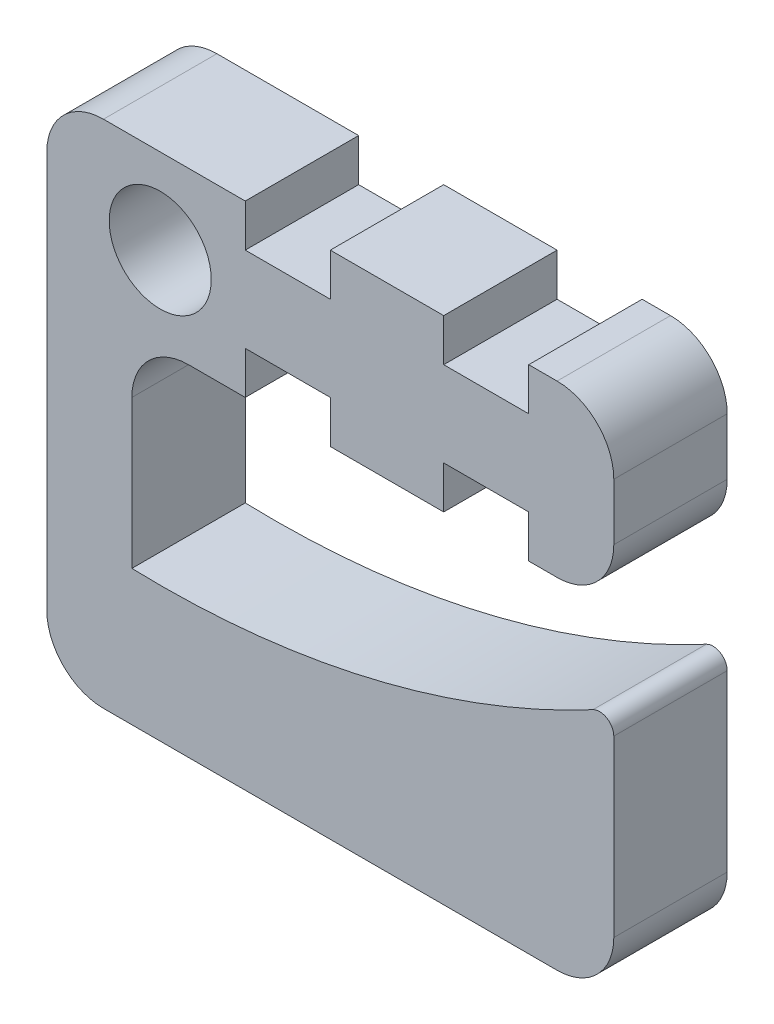
ISO-10303-21;
HEADER;
FILE_DESCRIPTION(('STEP AP214'),'2;1');
FILE_NAME('part.step','',(''),(''),'','','');
FILE_SCHEMA(('AUTOMOTIVE_DESIGN { 1 0 10303 214 1 1 1 1 }'));
ENDSEC;
DATA;
#1=APPLICATION_CONTEXT('core data for automotive mechanical design processes');
#2=APPLICATION_PROTOCOL_DEFINITION('international standard','automotive_design',2000,#1);
#3=PRODUCT_CONTEXT('',#1,'mechanical');
#4=PRODUCT('Part','Part','',(#3));
#5=PRODUCT_RELATED_PRODUCT_CATEGORY('part','',(#4));
#6=PRODUCT_DEFINITION_FORMATION('','',#4);
#7=PRODUCT_DEFINITION_CONTEXT('part definition',#1,'design');
#8=PRODUCT_DEFINITION('design','',#6,#7);
#9=PRODUCT_DEFINITION_SHAPE('','',#8);
#10=(LENGTH_UNIT() NAMED_UNIT(*) SI_UNIT(.MILLI.,.METRE.));
#11=(NAMED_UNIT(*) PLANE_ANGLE_UNIT() SI_UNIT($,.RADIAN.));
#12=(NAMED_UNIT(*) SI_UNIT($,.STERADIAN.) SOLID_ANGLE_UNIT());
#13=UNCERTAINTY_MEASURE_WITH_UNIT(LENGTH_MEASURE(1.E-05),#10,'distance_accuracy_value','');
#14=(GEOMETRIC_REPRESENTATION_CONTEXT(3) GLOBAL_UNCERTAINTY_ASSIGNED_CONTEXT((#13)) GLOBAL_UNIT_ASSIGNED_CONTEXT((#10,
#11,#12)) REPRESENTATION_CONTEXT('',''));
#15=CARTESIAN_POINT('',(0.,0.,0.));
#16=DIRECTION('',(0.,0.,1.));
#17=DIRECTION('',(1.,0.,0.));
#18=AXIS2_PLACEMENT_3D('',#15,#16,#17);
#19=CARTESIAN_POINT('',(0.,-3.81,5.08));
#20=DIRECTION('',(0.,-1.,0.));
#21=DIRECTION('',(1.,0.,0.));
#22=AXIS2_PLACEMENT_3D('',#19,#20,#21);
#23=PLANE('',#22);
#24=DIRECTION('',(-1.,0.,0.));
#25=VECTOR('',#24,1.);
#26=CARTESIAN_POINT('',(0.,-3.81,0.));
#27=LINE('',#26,#25);
#28=CARTESIAN_POINT('',(3.81,-3.81,0.));
#29=VERTEX_POINT('',#28);
#30=CARTESIAN_POINT('',(1.27,-3.81,0.));
#31=VERTEX_POINT('',#30);
#32=EDGE_CURVE('E466',#29,#31,#27,.T.);
#33=ORIENTED_EDGE('',*,*,#32,.F.);
#34=DIRECTION('',(0.,0.,1.));
#35=VECTOR('',#34,1.);
#36=CARTESIAN_POINT('',(3.81,-3.81,0.));
#37=LINE('',#36,#35);
#38=CARTESIAN_POINT('',(3.81,-3.81,5.08));
#39=VERTEX_POINT('',#38);
#40=EDGE_CURVE('E310',#29,#39,#37,.T.);
#41=ORIENTED_EDGE('',*,*,#40,.T.);
#42=DIRECTION('',(-1.,0.,0.));
#43=VECTOR('',#42,1.);
#44=CARTESIAN_POINT('',(0.,-3.81,5.08));
#45=LINE('',#44,#43);
#46=CARTESIAN_POINT('',(1.27,-3.81,5.08));
#47=VERTEX_POINT('',#46);
#48=EDGE_CURVE('E427',#39,#47,#45,.T.);
#49=ORIENTED_EDGE('',*,*,#48,.T.);
#50=DIRECTION('',(0.,0.,-1.));
#51=VECTOR('',#50,1.);
#52=CARTESIAN_POINT('',(1.27,-3.81,0.));
#53=LINE('',#52,#51);
#54=EDGE_CURVE('E485',#47,#31,#53,.T.);
#55=ORIENTED_EDGE('',*,*,#54,.T.);
#56=EDGE_LOOP('',(#33,#41,#49,#55));
#57=FACE_BOUND('',#56,.T.);
#58=ADVANCED_FACE('F45',(#57),#23,.T.);
#59=DIRECTION('',(0.,0.,1.));
#60=VECTOR('',#59,1.);
#61=CARTESIAN_POINT('',(7.62,-3.81,0.));
#62=LINE('',#61,#60);
#63=CARTESIAN_POINT('',(7.62,-3.81,0.));
#64=VERTEX_POINT('',#63);
#65=CARTESIAN_POINT('',(7.62,-3.81,5.08));
#66=VERTEX_POINT('',#65);
#67=EDGE_CURVE('E329',#64,#66,#62,.T.);
#68=ORIENTED_EDGE('',*,*,#67,.F.);
#69=CARTESIAN_POINT('',(12.7,-3.81,0.));
#70=VERTEX_POINT('',#69);
#71=EDGE_CURVE('E470',#70,#64,#27,.T.);
#72=ORIENTED_EDGE('',*,*,#71,.F.);
#73=DIRECTION('',(0.,0.,1.));
#74=VECTOR('',#73,1.);
#75=CARTESIAN_POINT('',(12.7,-3.81,0.));
#76=LINE('',#75,#74);
#77=CARTESIAN_POINT('',(12.7,-3.81,5.08));
#78=VERTEX_POINT('',#77);
#79=EDGE_CURVE('E293',#70,#78,#76,.T.);
#80=ORIENTED_EDGE('',*,*,#79,.T.);
#81=EDGE_CURVE('E433',#78,#66,#45,.T.);
#82=ORIENTED_EDGE('',*,*,#81,.T.);
#83=EDGE_LOOP('',(#68,#72,#80,#82));
#84=FACE_BOUND('',#83,.T.);
#85=ADVANCED_FACE('F606',(#84),#23,.T.);
#86=CARTESIAN_POINT('',(0.,3.81,5.08));
#87=DIRECTION('',(0.,-1.,0.));
#88=DIRECTION('',(1.,0.,0.));
#89=AXIS2_PLACEMENT_3D('',#86,#87,#88);
#90=PLANE('',#89);
#91=DIRECTION('',(0.,0.,1.));
#92=VECTOR('',#91,1.);
#93=CARTESIAN_POINT('',(16.51,3.81,0.));
#94=LINE('',#93,#92);
#95=CARTESIAN_POINT('',(16.51,3.81,0.));
#96=VERTEX_POINT('',#95);
#97=CARTESIAN_POINT('',(16.51,3.81,5.08));
#98=VERTEX_POINT('',#97);
#99=EDGE_CURVE('E346',#96,#98,#94,.T.);
#100=ORIENTED_EDGE('',*,*,#99,.T.);
#101=DIRECTION('',(-1.,0.,0.));
#102=VECTOR('',#101,1.);
#103=CARTESIAN_POINT('',(0.,3.81,5.08));
#104=LINE('',#103,#102);
#105=CARTESIAN_POINT('',(17.78,3.81,5.08));
#106=VERTEX_POINT('',#105);
#107=EDGE_CURVE('E438',#106,#98,#104,.T.);
#108=ORIENTED_EDGE('',*,*,#107,.F.);
#109=DIRECTION('',(0.,0.,-1.));
#110=VECTOR('',#109,1.);
#111=CARTESIAN_POINT('',(17.78,3.81,5.08));
#112=LINE('',#111,#110);
#113=CARTESIAN_POINT('',(17.78,3.81,0.));
#114=VERTEX_POINT('',#113);
#115=EDGE_CURVE('E541',#106,#114,#112,.T.);
#116=ORIENTED_EDGE('',*,*,#115,.T.);
#117=DIRECTION('',(-1.,0.,0.));
#118=VECTOR('',#117,1.);
#119=CARTESIAN_POINT('',(0.,3.81,0.));
#120=LINE('',#119,#118);
#121=EDGE_CURVE('E408',#114,#96,#120,.T.);
#122=ORIENTED_EDGE('',*,*,#121,.T.);
#123=EDGE_LOOP('',(#100,#108,#116,#122));
#124=FACE_BOUND('',#123,.T.);
#125=ADVANCED_FACE('F635',(#124),#90,.F.);
#126=CARTESIAN_POINT('',(12.7,3.81,5.08));
#127=VERTEX_POINT('',#126);
#128=CARTESIAN_POINT('',(7.62,3.81,5.08));
#129=VERTEX_POINT('',#128);
#130=EDGE_CURVE('E443',#127,#129,#104,.T.);
#131=ORIENTED_EDGE('',*,*,#130,.F.);
#132=DIRECTION('',(0.,0.,1.));
#133=VECTOR('',#132,1.);
#134=CARTESIAN_POINT('',(12.7,3.81,0.));
#135=LINE('',#134,#133);
#136=CARTESIAN_POINT('',(12.7,3.81,0.));
#137=VERTEX_POINT('',#136);
#138=EDGE_CURVE('E361',#137,#127,#135,.T.);
#139=ORIENTED_EDGE('',*,*,#138,.F.);
#140=CARTESIAN_POINT('',(7.62,3.81,0.));
#141=VERTEX_POINT('',#140);
#142=EDGE_CURVE('E478',#137,#141,#120,.T.);
#143=ORIENTED_EDGE('',*,*,#142,.T.);
#144=DIRECTION('',(0.,0.,1.));
#145=VECTOR('',#144,1.);
#146=CARTESIAN_POINT('',(7.62,3.81,0.));
#147=LINE('',#146,#145);
#148=EDGE_CURVE('E379',#141,#129,#147,.T.);
#149=ORIENTED_EDGE('',*,*,#148,.T.);
#150=EDGE_LOOP('',(#131,#139,#143,#149));
#151=FACE_BOUND('',#150,.T.);
#152=ADVANCED_FACE('F677',(#151),#90,.F.);
#153=CARTESIAN_POINT('',(0.,0.,5.08));
#154=DIRECTION('',(0.,0.,1.));
#155=DIRECTION('',(1.,0.,0.));
#156=AXIS2_PLACEMENT_3D('',#153,#154,#155);
#157=PLANE('',#156);
#158=CARTESIAN_POINT('',(0.,0.,5.08));
#159=DIRECTION('',(0.,0.,1.));
#160=DIRECTION('',(1.,0.,0.));
#161=AXIS2_PLACEMENT_3D('',#158,#159,#160);
#162=CIRCLE('',#161,2.286);
#163=CARTESIAN_POINT('',(2.286,0.,5.08));
#164=VERTEX_POINT('',#163);
#165=EDGE_CURVE('E403',#164,#164,#162,.T.);
#166=ORIENTED_EDGE('',*,*,#165,.F.);
#167=EDGE_LOOP('',(#166));
#168=FACE_BOUND('',#167,.T.);
#169=ORIENTED_EDGE('',*,*,#48,.F.);
#170=DIRECTION('',(0.,1.,0.));
#171=VECTOR('',#170,1.);
#172=CARTESIAN_POINT('',(3.81,0.,5.08));
#173=LINE('',#172,#171);
#174=CARTESIAN_POINT('',(3.81,-1.905,5.08));
#175=VERTEX_POINT('',#174);
#176=EDGE_CURVE('E311',#39,#175,#173,.T.);
#177=ORIENTED_EDGE('',*,*,#176,.T.);
#178=DIRECTION('',(1.,0.,0.));
#179=VECTOR('',#178,1.);
#180=CARTESIAN_POINT('',(0.,-1.905,5.08));
#181=LINE('',#180,#179);
#182=CARTESIAN_POINT('',(7.62,-1.905,5.08));
#183=VERTEX_POINT('',#182);
#184=EDGE_CURVE('E303',#175,#183,#181,.T.);
#185=ORIENTED_EDGE('',*,*,#184,.T.);
#186=DIRECTION('',(0.,1.,0.));
#187=VECTOR('',#186,1.);
#188=CARTESIAN_POINT('',(7.62,0.,5.08));
#189=LINE('',#188,#187);
#190=EDGE_CURVE('E315',#66,#183,#189,.T.);
#191=ORIENTED_EDGE('',*,*,#190,.F.);
#192=ORIENTED_EDGE('',*,*,#81,.F.);
#193=DIRECTION('',(0.,1.,0.));
#194=VECTOR('',#193,1.);
#195=CARTESIAN_POINT('',(12.7,0.,5.08));
#196=LINE('',#195,#194);
#197=CARTESIAN_POINT('',(12.7,-1.905,5.08));
#198=VERTEX_POINT('',#197);
#199=EDGE_CURVE('E276',#78,#198,#196,.T.);
#200=ORIENTED_EDGE('',*,*,#199,.T.);
#201=DIRECTION('',(-1.,0.,0.));
#202=VECTOR('',#201,1.);
#203=CARTESIAN_POINT('',(0.,-1.905,5.08));
#204=LINE('',#203,#202);
#205=CARTESIAN_POINT('',(16.51,-1.905,5.08));
#206=VERTEX_POINT('',#205);
#207=EDGE_CURVE('E280',#206,#198,#204,.T.);
#208=ORIENTED_EDGE('',*,*,#207,.F.);
#209=DIRECTION('',(0.,1.,0.));
#210=VECTOR('',#209,1.);
#211=CARTESIAN_POINT('',(16.51,0.,5.08));
#212=LINE('',#211,#210);
#213=CARTESIAN_POINT('',(16.51,-3.81,5.08));
#214=VERTEX_POINT('',#213);
#215=EDGE_CURVE('E254',#214,#206,#212,.T.);
#216=ORIENTED_EDGE('',*,*,#215,.F.);
#217=CARTESIAN_POINT('',(17.78,-3.81,5.08));
#218=VERTEX_POINT('',#217);
#219=EDGE_CURVE('E428',#218,#214,#45,.T.);
#220=ORIENTED_EDGE('',*,*,#219,.F.);
#221=CARTESIAN_POINT('',(17.78,-1.27,5.08));
#222=DIRECTION('',(0.,0.,1.));
#223=DIRECTION('',(1.,0.,0.));
#224=AXIS2_PLACEMENT_3D('',#221,#222,#223);
#225=CIRCLE('',#224,2.54);
#226=CARTESIAN_POINT('',(20.32,-1.27,5.08));
#227=VERTEX_POINT('',#226);
#228=EDGE_CURVE('E519',#218,#227,#225,.T.);
#229=ORIENTED_EDGE('',*,*,#228,.T.);
#230=DIRECTION('',(0.,1.,0.));
#231=VECTOR('',#230,1.);
#232=CARTESIAN_POINT('',(20.32,0.,5.08));
#233=LINE('',#232,#231);
#234=CARTESIAN_POINT('',(20.32,1.27,5.08));
#235=VERTEX_POINT('',#234);
#236=EDGE_CURVE('E432',#227,#235,#233,.T.);
#237=ORIENTED_EDGE('',*,*,#236,.T.);
#238=CARTESIAN_POINT('',(17.78,1.27,5.08));
#239=DIRECTION('',(0.,0.,1.));
#240=DIRECTION('',(1.,0.,0.));
#241=AXIS2_PLACEMENT_3D('',#238,#239,#240);
#242=CIRCLE('',#241,2.54);
#243=EDGE_CURVE('E522',#235,#106,#242,.T.);
#244=ORIENTED_EDGE('',*,*,#243,.T.);
#245=ORIENTED_EDGE('',*,*,#107,.T.);
#246=DIRECTION('',(0.,-1.,0.));
#247=VECTOR('',#246,1.);
#248=CARTESIAN_POINT('',(16.51,0.,5.08));
#249=LINE('',#248,#247);
#250=CARTESIAN_POINT('',(16.51,1.905,5.08));
#251=VERTEX_POINT('',#250);
#252=EDGE_CURVE('E292',#98,#251,#249,.T.);
#253=ORIENTED_EDGE('',*,*,#252,.T.);
#254=DIRECTION('',(-1.,0.,0.));
#255=VECTOR('',#254,1.);
#256=CARTESIAN_POINT('',(0.,1.90499999999999,5.08));
#257=LINE('',#256,#255);
#258=CARTESIAN_POINT('',(12.7,1.905,5.08));
#259=VERTEX_POINT('',#258);
#260=EDGE_CURVE('E339',#251,#259,#257,.T.);
#261=ORIENTED_EDGE('',*,*,#260,.T.);
#262=DIRECTION('',(0.,-1.,0.));
#263=VECTOR('',#262,1.);
#264=CARTESIAN_POINT('',(12.7,0.,5.08));
#265=LINE('',#264,#263);
#266=EDGE_CURVE('E350',#127,#259,#265,.T.);
#267=ORIENTED_EDGE('',*,*,#266,.F.);
#268=ORIENTED_EDGE('',*,*,#130,.T.);
#269=DIRECTION('',(0.,-1.,0.));
#270=VECTOR('',#269,1.);
#271=CARTESIAN_POINT('',(7.62,0.,5.08));
#272=LINE('',#271,#270);
#273=CARTESIAN_POINT('',(7.62,1.905,5.08));
#274=VERTEX_POINT('',#273);
#275=EDGE_CURVE('E326',#129,#274,#272,.T.);
#276=ORIENTED_EDGE('',*,*,#275,.T.);
#277=DIRECTION('',(1.,0.,0.));
#278=VECTOR('',#277,1.);
#279=CARTESIAN_POINT('',(0.,1.905,5.08));
#280=LINE('',#279,#278);
#281=CARTESIAN_POINT('',(3.81,1.905,5.08));
#282=VERTEX_POINT('',#281);
#283=EDGE_CURVE('E371',#282,#274,#280,.T.);
#284=ORIENTED_EDGE('',*,*,#283,.F.);
#285=DIRECTION('',(0.,-1.,0.));
#286=VECTOR('',#285,1.);
#287=CARTESIAN_POINT('',(3.81,0.,5.08));
#288=LINE('',#287,#286);
#289=CARTESIAN_POINT('',(3.81,3.81,5.08));
#290=VERTEX_POINT('',#289);
#291=EDGE_CURVE('E383',#290,#282,#288,.T.);
#292=ORIENTED_EDGE('',*,*,#291,.F.);
#293=CARTESIAN_POINT('',(-2.54,3.81,5.08));
#294=VERTEX_POINT('',#293);
#295=EDGE_CURVE('E437',#290,#294,#104,.T.);
#296=ORIENTED_EDGE('',*,*,#295,.T.);
#297=CARTESIAN_POINT('',(-2.54,1.27,5.08));
#298=DIRECTION('',(0.,0.,1.));
#299=DIRECTION('',(1.,0.,0.));
#300=AXIS2_PLACEMENT_3D('',#297,#298,#299);
#301=CIRCLE('',#300,2.54);
#302=CARTESIAN_POINT('',(-5.08,1.27,5.08));
#303=VERTEX_POINT('',#302);
#304=EDGE_CURVE('E525',#294,#303,#301,.T.);
#305=ORIENTED_EDGE('',*,*,#304,.T.);
#306=DIRECTION('',(0.,1.,0.));
#307=VECTOR('',#306,1.);
#308=CARTESIAN_POINT('',(-5.08,0.,5.08));
#309=LINE('',#308,#307);
#310=CARTESIAN_POINT('',(-5.08,-16.51,5.08));
#311=VERTEX_POINT('',#310);
#312=EDGE_CURVE('E407',#311,#303,#309,.T.);
#313=ORIENTED_EDGE('',*,*,#312,.F.);
#314=CARTESIAN_POINT('',(-2.54,-16.51,5.08));
#315=DIRECTION('',(0.,0.,1.));
#316=DIRECTION('',(1.,0.,0.));
#317=AXIS2_PLACEMENT_3D('',#314,#315,#316);
#318=CIRCLE('',#317,2.54);
#319=CARTESIAN_POINT('',(-2.54,-19.05,5.08));
#320=VERTEX_POINT('',#319);
#321=EDGE_CURVE('E528',#311,#320,#318,.T.);
#322=ORIENTED_EDGE('',*,*,#321,.T.);
#323=DIRECTION('',(1.,0.,0.));
#324=VECTOR('',#323,1.);
#325=CARTESIAN_POINT('',(0.,-19.05,5.08));
#326=LINE('',#325,#324);
#327=CARTESIAN_POINT('',(17.78,-19.05,5.08));
#328=VERTEX_POINT('',#327);
#329=EDGE_CURVE('E412',#320,#328,#326,.T.);
#330=ORIENTED_EDGE('',*,*,#329,.T.);
#331=CARTESIAN_POINT('',(17.78,-16.51,5.08));
#332=DIRECTION('',(0.,0.,1.));
#333=DIRECTION('',(1.,0.,0.));
#334=AXIS2_PLACEMENT_3D('',#331,#332,#333);
#335=CIRCLE('',#334,2.54);
#336=CARTESIAN_POINT('',(20.32,-16.51,5.08));
#337=VERTEX_POINT('',#336);
#338=EDGE_CURVE('E531',#328,#337,#335,.T.);
#339=ORIENTED_EDGE('',*,*,#338,.T.);
#340=DIRECTION('',(0.,1.,0.));
#341=VECTOR('',#340,1.);
#342=CARTESIAN_POINT('',(20.32,0.,5.08));
#343=LINE('',#342,#341);
#344=CARTESIAN_POINT('',(20.32,-8.69641263375921,5.08));
#345=VERTEX_POINT('',#344);
#346=EDGE_CURVE('E416',#337,#345,#343,.T.);
#347=ORIENTED_EDGE('',*,*,#346,.T.);
#348=CARTESIAN_POINT('',(19.685,-8.69641263375921,5.08));
#349=DIRECTION('',(0.,0.,1.));
#350=DIRECTION('',(1.,0.,0.));
#351=AXIS2_PLACEMENT_3D('',#348,#349,#350);
#352=CIRCLE('',#351,0.635);
#353=CARTESIAN_POINT('',(19.385099474173,-8.13669424509515,5.08));
#354=VERTEX_POINT('',#353);
#355=EDGE_CURVE('E11',#345,#354,#352,.T.);
#356=ORIENTED_EDGE('',*,*,#355,.T.);
#357=CARTESIAN_POINT('',(0.,28.042624253455,5.08));
#358=DIRECTION('',(0.,0.,1.));
#359=DIRECTION('',(1.,0.,0.));
#360=AXIS2_PLACEMENT_3D('',#357,#358,#359);
#361=CIRCLE('',#360,41.0454037456463);
#362=CARTESIAN_POINT('',(-1.27,-12.9831270333053,5.08));
#363=VERTEX_POINT('',#362);
#364=EDGE_CURVE('E420',#354,#363,#361,.F.);
#365=ORIENTED_EDGE('',*,*,#364,.T.);
#366=DIRECTION('',(0.,-1.,0.));
#367=VECTOR('',#366,1.);
#368=CARTESIAN_POINT('',(-1.27,0.,5.08));
#369=LINE('',#368,#367);
#370=CARTESIAN_POINT('',(-1.27,-6.35,5.08));
#371=VERTEX_POINT('',#370);
#372=EDGE_CURVE('E423',#371,#363,#369,.T.);
#373=ORIENTED_EDGE('',*,*,#372,.F.);
#374=CARTESIAN_POINT('',(1.27,-6.35,5.08));
#375=DIRECTION('',(0.,0.,1.));
#376=DIRECTION('',(1.,0.,0.));
#377=AXIS2_PLACEMENT_3D('',#374,#375,#376);
#378=CIRCLE('',#377,2.54);
#379=EDGE_CURVE('E559',#371,#47,#378,.F.);
#380=ORIENTED_EDGE('',*,*,#379,.T.);
#381=EDGE_LOOP('',(#169,#177,#185,#191,#192,#200,#208,#216,#220,#229,#237,#244,#245,#253,#261,
#267,#268,#276,#284,#292,#296,#305,#313,#322,#330,#339,#347,#356,#365,#373,#380));
#382=FACE_BOUND('',#381,.T.);
#383=ADVANCED_FACE('F580',(#168,#382),#157,.T.);
#384=CARTESIAN_POINT('',(0.,0.,0.));
#385=DIRECTION('',(0.,0.,1.));
#386=DIRECTION('',(1.,0.,0.));
#387=AXIS2_PLACEMENT_3D('',#384,#385,#386);
#388=PLANE('',#387);
#389=CARTESIAN_POINT('',(0.,0.,0.));
#390=DIRECTION('',(0.,0.,1.));
#391=DIRECTION('',(1.,0.,0.));
#392=AXIS2_PLACEMENT_3D('',#389,#390,#391);
#393=CIRCLE('',#392,2.286);
#394=CARTESIAN_POINT('',(2.286,0.,0.));
#395=VERTEX_POINT('',#394);
#396=EDGE_CURVE('E393',#395,#395,#393,.T.);
#397=ORIENTED_EDGE('',*,*,#396,.T.);
#398=EDGE_LOOP('',(#397));
#399=FACE_BOUND('',#398,.T.);
#400=DIRECTION('',(0.,1.,0.));
#401=VECTOR('',#400,1.);
#402=CARTESIAN_POINT('',(3.81,0.,0.));
#403=LINE('',#402,#401);
#404=CARTESIAN_POINT('',(3.81,-1.905,0.));
#405=VERTEX_POINT('',#404);
#406=EDGE_CURVE('E299',#29,#405,#403,.T.);
#407=ORIENTED_EDGE('',*,*,#406,.F.);
#408=ORIENTED_EDGE('',*,*,#32,.T.);
#409=CARTESIAN_POINT('',(1.27,-6.35,0.));
#410=DIRECTION('',(0.,0.,1.));
#411=DIRECTION('',(1.,0.,0.));
#412=AXIS2_PLACEMENT_3D('',#409,#410,#411);
#413=CIRCLE('',#412,2.54);
#414=CARTESIAN_POINT('',(-1.27,-6.35,0.));
#415=VERTEX_POINT('',#414);
#416=EDGE_CURVE('E556',#31,#415,#413,.T.);
#417=ORIENTED_EDGE('',*,*,#416,.T.);
#418=DIRECTION('',(0.,-1.,0.));
#419=VECTOR('',#418,1.);
#420=CARTESIAN_POINT('',(-1.27,0.,0.));
#421=LINE('',#420,#419);
#422=CARTESIAN_POINT('',(-1.27,-12.9831270333053,0.));
#423=VERTEX_POINT('',#422);
#424=EDGE_CURVE('E462',#415,#423,#421,.T.);
#425=ORIENTED_EDGE('',*,*,#424,.T.);
#426=CARTESIAN_POINT('',(0.,28.042624253455,0.));
#427=DIRECTION('',(0.,0.,1.));
#428=DIRECTION('',(1.,0.,0.));
#429=AXIS2_PLACEMENT_3D('',#426,#427,#428);
#430=CIRCLE('',#429,41.0454037456463);
#431=CARTESIAN_POINT('',(19.385099474173,-8.13669424509515,0.));
#432=VERTEX_POINT('',#431);
#433=EDGE_CURVE('E459',#432,#423,#430,.F.);
#434=ORIENTED_EDGE('',*,*,#433,.F.);
#435=CARTESIAN_POINT('',(19.685,-8.69641263375921,0.));
#436=DIRECTION('',(0.,0.,1.));
#437=DIRECTION('',(1.,0.,0.));
#438=AXIS2_PLACEMENT_3D('',#435,#436,#437);
#439=CIRCLE('',#438,0.635);
#440=CARTESIAN_POINT('',(20.32,-8.69641263375921,0.));
#441=VERTEX_POINT('',#440);
#442=EDGE_CURVE('E567',#432,#441,#439,.F.);
#443=ORIENTED_EDGE('',*,*,#442,.T.);
#444=DIRECTION('',(0.,1.,0.));
#445=VECTOR('',#444,1.);
#446=CARTESIAN_POINT('',(20.32,0.,0.));
#447=LINE('',#446,#445);
#448=CARTESIAN_POINT('',(20.32,-16.51,0.));
#449=VERTEX_POINT('',#448);
#450=EDGE_CURVE('E455',#449,#441,#447,.T.);
#451=ORIENTED_EDGE('',*,*,#450,.F.);
#452=CARTESIAN_POINT('',(17.78,-16.51,0.));
#453=DIRECTION('',(0.,0.,1.));
#454=DIRECTION('',(1.,0.,0.));
#455=AXIS2_PLACEMENT_3D('',#452,#453,#454);
#456=CIRCLE('',#455,2.54);
#457=CARTESIAN_POINT('',(17.78,-19.05,0.));
#458=VERTEX_POINT('',#457);
#459=EDGE_CURVE('E509',#449,#458,#456,.F.);
#460=ORIENTED_EDGE('',*,*,#459,.T.);
#461=DIRECTION('',(1.,0.,0.));
#462=VECTOR('',#461,1.);
#463=CARTESIAN_POINT('',(0.,-19.05,0.));
#464=LINE('',#463,#462);
#465=CARTESIAN_POINT('',(-2.54,-19.05,0.));
#466=VERTEX_POINT('',#465);
#467=EDGE_CURVE('E451',#466,#458,#464,.T.);
#468=ORIENTED_EDGE('',*,*,#467,.F.);
#469=CARTESIAN_POINT('',(-2.54,-16.51,0.));
#470=DIRECTION('',(0.,0.,1.));
#471=DIRECTION('',(1.,0.,0.));
#472=AXIS2_PLACEMENT_3D('',#469,#470,#471);
#473=CIRCLE('',#472,2.54);
#474=CARTESIAN_POINT('',(-5.08,-16.51,0.));
#475=VERTEX_POINT('',#474);
#476=EDGE_CURVE('E506',#466,#475,#473,.F.);
#477=ORIENTED_EDGE('',*,*,#476,.T.);
#478=DIRECTION('',(0.,1.,0.));
#479=VECTOR('',#478,1.);
#480=CARTESIAN_POINT('',(-5.08,0.,0.));
#481=LINE('',#480,#479);
#482=CARTESIAN_POINT('',(-5.08,1.27,0.));
#483=VERTEX_POINT('',#482);
#484=EDGE_CURVE('E447',#475,#483,#481,.T.);
#485=ORIENTED_EDGE('',*,*,#484,.T.);
#486=CARTESIAN_POINT('',(-2.54,1.27,0.));
#487=DIRECTION('',(0.,0.,1.));
#488=DIRECTION('',(1.,0.,0.));
#489=AXIS2_PLACEMENT_3D('',#486,#487,#488);
#490=CIRCLE('',#489,2.54);
#491=CARTESIAN_POINT('',(-2.54,3.81,0.));
#492=VERTEX_POINT('',#491);
#493=EDGE_CURVE('E502',#483,#492,#490,.F.);
#494=ORIENTED_EDGE('',*,*,#493,.T.);
#495=CARTESIAN_POINT('',(3.81,3.81,0.));
#496=VERTEX_POINT('',#495);
#497=EDGE_CURVE('E474',#496,#492,#120,.T.);
#498=ORIENTED_EDGE('',*,*,#497,.F.);
#499=DIRECTION('',(0.,-1.,0.));
#500=VECTOR('',#499,1.);
#501=CARTESIAN_POINT('',(3.81,0.,0.));
#502=LINE('',#501,#500);
#503=CARTESIAN_POINT('',(3.81,1.905,0.));
#504=VERTEX_POINT('',#503);
#505=EDGE_CURVE('E370',#496,#504,#502,.T.);
#506=ORIENTED_EDGE('',*,*,#505,.T.);
#507=DIRECTION('',(1.,0.,0.));
#508=VECTOR('',#507,1.);
#509=CARTESIAN_POINT('',(0.,1.905,0.));
#510=LINE('',#509,#508);
#511=CARTESIAN_POINT('',(7.62,1.905,0.));
#512=VERTEX_POINT('',#511);
#513=EDGE_CURVE('E375',#504,#512,#510,.T.);
#514=ORIENTED_EDGE('',*,*,#513,.T.);
#515=DIRECTION('',(0.,-1.,0.));
#516=VECTOR('',#515,1.);
#517=CARTESIAN_POINT('',(7.62,0.,0.));
#518=LINE('',#517,#516);
#519=EDGE_CURVE('E367',#141,#512,#518,.T.);
#520=ORIENTED_EDGE('',*,*,#519,.F.);
#521=ORIENTED_EDGE('',*,*,#142,.F.);
#522=DIRECTION('',(0.,-1.,0.));
#523=VECTOR('',#522,1.);
#524=CARTESIAN_POINT('',(12.7,0.,0.));
#525=LINE('',#524,#523);
#526=CARTESIAN_POINT('',(12.7,1.905,0.));
#527=VERTEX_POINT('',#526);
#528=EDGE_CURVE('E338',#137,#527,#525,.T.);
#529=ORIENTED_EDGE('',*,*,#528,.T.);
#530=DIRECTION('',(-1.,0.,0.));
#531=VECTOR('',#530,1.);
#532=CARTESIAN_POINT('',(0.,1.90499999999999,0.));
#533=LINE('',#532,#531);
#534=CARTESIAN_POINT('',(16.51,1.905,0.));
#535=VERTEX_POINT('',#534);
#536=EDGE_CURVE('E343',#535,#527,#533,.T.);
#537=ORIENTED_EDGE('',*,*,#536,.F.);
#538=DIRECTION('',(0.,-1.,0.));
#539=VECTOR('',#538,1.);
#540=CARTESIAN_POINT('',(16.51,0.,0.));
#541=LINE('',#540,#539);
#542=EDGE_CURVE('E335',#96,#535,#541,.T.);
#543=ORIENTED_EDGE('',*,*,#542,.F.);
#544=ORIENTED_EDGE('',*,*,#121,.F.);
#545=CARTESIAN_POINT('',(17.78,1.27,0.));
#546=DIRECTION('',(0.,0.,1.));
#547=DIRECTION('',(1.,0.,0.));
#548=AXIS2_PLACEMENT_3D('',#545,#546,#547);
#549=CIRCLE('',#548,2.54);
#550=CARTESIAN_POINT('',(20.32,1.27,0.));
#551=VERTEX_POINT('',#550);
#552=EDGE_CURVE('E499',#114,#551,#549,.F.);
#553=ORIENTED_EDGE('',*,*,#552,.T.);
#554=DIRECTION('',(0.,1.,0.));
#555=VECTOR('',#554,1.);
#556=CARTESIAN_POINT('',(20.32,0.,0.));
#557=LINE('',#556,#555);
#558=CARTESIAN_POINT('',(20.32,-1.27,0.));
#559=VERTEX_POINT('',#558);
#560=EDGE_CURVE('E469',#559,#551,#557,.T.);
#561=ORIENTED_EDGE('',*,*,#560,.F.);
#562=CARTESIAN_POINT('',(17.78,-1.27,0.));
#563=DIRECTION('',(0.,0.,1.));
#564=DIRECTION('',(1.,0.,0.));
#565=AXIS2_PLACEMENT_3D('',#562,#563,#564);
#566=CIRCLE('',#565,2.54);
#567=CARTESIAN_POINT('',(17.78,-3.81,0.));
#568=VERTEX_POINT('',#567);
#569=EDGE_CURVE('E496',#559,#568,#566,.F.);
#570=ORIENTED_EDGE('',*,*,#569,.T.);
#571=CARTESIAN_POINT('',(16.51,-3.81,0.));
#572=VERTEX_POINT('',#571);
#573=EDGE_CURVE('E274',#568,#572,#27,.T.);
#574=ORIENTED_EDGE('',*,*,#573,.T.);
#575=DIRECTION('',(0.,1.,0.));
#576=VECTOR('',#575,1.);
#577=CARTESIAN_POINT('',(16.51,0.,0.));
#578=LINE('',#577,#576);
#579=CARTESIAN_POINT('',(16.51,-1.905,0.));
#580=VERTEX_POINT('',#579);
#581=EDGE_CURVE('E251',#572,#580,#578,.T.);
#582=ORIENTED_EDGE('',*,*,#581,.T.);
#583=DIRECTION('',(-1.,0.,0.));
#584=VECTOR('',#583,1.);
#585=CARTESIAN_POINT('',(0.,-1.905,0.));
#586=LINE('',#585,#584);
#587=CARTESIAN_POINT('',(12.7,-1.905,0.));
#588=VERTEX_POINT('',#587);
#589=EDGE_CURVE('E263',#580,#588,#586,.T.);
#590=ORIENTED_EDGE('',*,*,#589,.T.);
#591=DIRECTION('',(0.,1.,0.));
#592=VECTOR('',#591,1.);
#593=CARTESIAN_POINT('',(12.7,0.,0.));
#594=LINE('',#593,#592);
#595=EDGE_CURVE('E260',#70,#588,#594,.T.);
#596=ORIENTED_EDGE('',*,*,#595,.F.);
#597=ORIENTED_EDGE('',*,*,#71,.T.);
#598=DIRECTION('',(0.,1.,0.));
#599=VECTOR('',#598,1.);
#600=CARTESIAN_POINT('',(7.62,0.,0.));
#601=LINE('',#600,#599);
#602=CARTESIAN_POINT('',(7.62,-1.905,0.));
#603=VERTEX_POINT('',#602);
#604=EDGE_CURVE('E302',#64,#603,#601,.T.);
#605=ORIENTED_EDGE('',*,*,#604,.T.);
#606=DIRECTION('',(1.,0.,0.));
#607=VECTOR('',#606,1.);
#608=CARTESIAN_POINT('',(0.,-1.905,0.));
#609=LINE('',#608,#607);
#610=EDGE_CURVE('E307',#405,#603,#609,.T.);
#611=ORIENTED_EDGE('',*,*,#610,.F.);
#612=EDGE_LOOP('',(#407,#408,#417,#425,#434,#443,#451,#460,#468,#477,#485,#494,#498,#506,#514,
#520,#521,#529,#537,#543,#544,#553,#561,#570,#574,#582,#590,#596,#597,#605,#611));
#613=FACE_BOUND('',#612,.T.);
#614=ADVANCED_FACE('F272',(#399,#613),#388,.F.);
#615=CARTESIAN_POINT('',(-5.08,0.,5.08));
#616=DIRECTION('',(-1.,0.,0.));
#617=DIRECTION('',(0.,0.,1.));
#618=AXIS2_PLACEMENT_3D('',#615,#616,#617);
#619=PLANE('',#618);
#620=ORIENTED_EDGE('',*,*,#484,.F.);
#621=DIRECTION('',(0.,0.,-1.));
#622=VECTOR('',#621,1.);
#623=CARTESIAN_POINT('',(-5.08,-16.51,5.08));
#624=LINE('',#623,#622);
#625=EDGE_CURVE('E538',#475,#311,#624,.F.);
#626=ORIENTED_EDGE('',*,*,#625,.T.);
#627=ORIENTED_EDGE('',*,*,#312,.T.);
#628=DIRECTION('',(0.,0.,-1.));
#629=VECTOR('',#628,1.);
#630=CARTESIAN_POINT('',(-5.08,1.27,0.));
#631=LINE('',#630,#629);
#632=EDGE_CURVE('E534',#303,#483,#631,.T.);
#633=ORIENTED_EDGE('',*,*,#632,.T.);
#634=EDGE_LOOP('',(#620,#626,#627,#633));
#635=FACE_BOUND('',#634,.T.);
#636=ADVANCED_FACE('F696',(#635),#619,.T.);
#637=CARTESIAN_POINT('',(0.,-19.05,5.08));
#638=DIRECTION('',(0.,1.,0.));
#639=DIRECTION('',(0.,0.,1.));
#640=AXIS2_PLACEMENT_3D('',#637,#638,#639);
#641=PLANE('',#640);
#642=ORIENTED_EDGE('',*,*,#467,.T.);
#643=DIRECTION('',(0.,0.,-1.));
#644=VECTOR('',#643,1.);
#645=CARTESIAN_POINT('',(17.78,-19.05,5.08));
#646=LINE('',#645,#644);
#647=EDGE_CURVE('E516',#458,#328,#646,.F.);
#648=ORIENTED_EDGE('',*,*,#647,.T.);
#649=ORIENTED_EDGE('',*,*,#329,.F.);
#650=DIRECTION('',(0.,0.,-1.));
#651=VECTOR('',#650,1.);
#652=CARTESIAN_POINT('',(-2.54,-19.05,0.));
#653=LINE('',#652,#651);
#654=EDGE_CURVE('E512',#320,#466,#653,.T.);
#655=ORIENTED_EDGE('',*,*,#654,.T.);
#656=EDGE_LOOP('',(#642,#648,#649,#655));
#657=FACE_BOUND('',#656,.T.);
#658=ADVANCED_FACE('F705',(#657),#641,.F.);
#659=CARTESIAN_POINT('',(20.32,0.,5.08));
#660=DIRECTION('',(-1.,0.,0.));
#661=DIRECTION('',(0.,0.,1.));
#662=AXIS2_PLACEMENT_3D('',#659,#660,#661);
#663=PLANE('',#662);
#664=ORIENTED_EDGE('',*,*,#450,.T.);
#665=DIRECTION('',(0.,0.,-1.));
#666=VECTOR('',#665,1.);
#667=CARTESIAN_POINT('',(20.32,-8.69641263375921,5.08));
#668=LINE('',#667,#666);
#669=EDGE_CURVE('E54',#441,#345,#668,.F.);
#670=ORIENTED_EDGE('',*,*,#669,.T.);
#671=ORIENTED_EDGE('',*,*,#346,.F.);
#672=DIRECTION('',(0.,0.,-1.));
#673=VECTOR('',#672,1.);
#674=CARTESIAN_POINT('',(20.32,-16.51,5.08));
#675=LINE('',#674,#673);
#676=EDGE_CURVE('E492',#337,#449,#675,.T.);
#677=ORIENTED_EDGE('',*,*,#676,.T.);
#678=EDGE_LOOP('',(#664,#670,#671,#677));
#679=FACE_BOUND('',#678,.T.);
#680=ADVANCED_FACE('F573',(#679),#663,.F.);
#681=CARTESIAN_POINT('',(0.,28.042624253455,5.08));
#682=DIRECTION('',(0.,0.,-1.));
#683=DIRECTION('',(-1.,0.,0.));
#684=AXIS2_PLACEMENT_3D('',#681,#682,#683);
#685=CYLINDRICAL_SURFACE('',#684,41.0454037456463);
#686=ORIENTED_EDGE('',*,*,#364,.F.);
#687=DIRECTION('',(0.,0.,-1.));
#688=VECTOR('',#687,1.);
#689=CARTESIAN_POINT('',(19.385099474173,-8.13669424509515,5.08));
#690=LINE('',#689,#688);
#691=EDGE_CURVE('E563',#354,#432,#690,.T.);
#692=ORIENTED_EDGE('',*,*,#691,.T.);
#693=ORIENTED_EDGE('',*,*,#433,.T.);
#694=DIRECTION('',(0.,0.,-1.));
#695=VECTOR('',#694,1.);
#696=CARTESIAN_POINT('',(-1.27,-12.9831270333053,5.08));
#697=LINE('',#696,#695);
#698=EDGE_CURVE('E442',#363,#423,#697,.T.);
#699=ORIENTED_EDGE('',*,*,#698,.F.);
#700=EDGE_LOOP('',(#686,#692,#693,#699));
#701=FACE_BOUND('',#700,.T.);
#702=ADVANCED_FACE('F586',(#701),#685,.F.);
#703=CARTESIAN_POINT('',(-1.27,0.,5.08));
#704=DIRECTION('',(1.,0.,0.));
#705=DIRECTION('',(0.,1.,0.));
#706=AXIS2_PLACEMENT_3D('',#703,#704,#705);
#707=PLANE('',#706);
#708=ORIENTED_EDGE('',*,*,#424,.F.);
#709=DIRECTION('',(0.,0.,-1.));
#710=VECTOR('',#709,1.);
#711=CARTESIAN_POINT('',(-1.27,-6.35,5.08));
#712=LINE('',#711,#710);
#713=EDGE_CURVE('E489',#415,#371,#712,.F.);
#714=ORIENTED_EDGE('',*,*,#713,.T.);
#715=ORIENTED_EDGE('',*,*,#372,.T.);
#716=ORIENTED_EDGE('',*,*,#698,.T.);
#717=EDGE_LOOP('',(#708,#714,#715,#716));
#718=FACE_BOUND('',#717,.T.);
#719=ADVANCED_FACE('F592',(#718),#707,.T.);
#720=DIRECTION('',(0.,0.,1.));
#721=VECTOR('',#720,1.);
#722=CARTESIAN_POINT('',(16.51,-3.81,0.));
#723=LINE('',#722,#721);
#724=EDGE_CURVE('E289',#572,#214,#723,.T.);
#725=ORIENTED_EDGE('',*,*,#724,.F.);
#726=ORIENTED_EDGE('',*,*,#573,.F.);
#727=DIRECTION('',(0.,0.,-1.));
#728=VECTOR('',#727,1.);
#729=CARTESIAN_POINT('',(17.78,-3.81,5.08));
#730=LINE('',#729,#728);
#731=EDGE_CURVE('E482',#568,#218,#730,.F.);
#732=ORIENTED_EDGE('',*,*,#731,.T.);
#733=ORIENTED_EDGE('',*,*,#219,.T.);
#734=EDGE_LOOP('',(#725,#726,#732,#733));
#735=FACE_BOUND('',#734,.T.);
#736=ADVANCED_FACE('F631',(#735),#23,.T.);
#737=CARTESIAN_POINT('',(20.32,0.,5.08));
#738=DIRECTION('',(-1.,0.,0.));
#739=DIRECTION('',(0.,0.,1.));
#740=AXIS2_PLACEMENT_3D('',#737,#738,#739);
#741=PLANE('',#740);
#742=ORIENTED_EDGE('',*,*,#560,.T.);
#743=DIRECTION('',(0.,0.,-1.));
#744=VECTOR('',#743,1.);
#745=CARTESIAN_POINT('',(20.32,1.27,5.08));
#746=LINE('',#745,#744);
#747=EDGE_CURVE('E553',#551,#235,#746,.F.);
#748=ORIENTED_EDGE('',*,*,#747,.T.);
#749=ORIENTED_EDGE('',*,*,#236,.F.);
#750=DIRECTION('',(0.,0.,-1.));
#751=VECTOR('',#750,1.);
#752=CARTESIAN_POINT('',(20.32,-1.27,0.));
#753=LINE('',#752,#751);
#754=EDGE_CURVE('E549',#227,#559,#753,.T.);
#755=ORIENTED_EDGE('',*,*,#754,.T.);
#756=EDGE_LOOP('',(#742,#748,#749,#755));
#757=FACE_BOUND('',#756,.T.);
#758=ADVANCED_FACE('F639',(#757),#741,.F.);
#759=CARTESIAN_POINT('',(0.,0.,5.08));
#760=DIRECTION('',(0.,0.,-1.));
#761=DIRECTION('',(-1.,0.,0.));
#762=AXIS2_PLACEMENT_3D('',#759,#760,#761);
#763=CYLINDRICAL_SURFACE('',#762,2.286);
#764=ORIENTED_EDGE('',*,*,#165,.T.);
#765=EDGE_LOOP('',(#764));
#766=FACE_BOUND('',#765,.T.);
#767=ORIENTED_EDGE('',*,*,#396,.F.);
#768=EDGE_LOOP('',(#767));
#769=FACE_BOUND('',#768,.T.);
#770=ADVANCED_FACE('F645',(#766,#769),#763,.F.);
#771=ORIENTED_EDGE('',*,*,#295,.F.);
#772=DIRECTION('',(0.,0.,1.));
#773=VECTOR('',#772,1.);
#774=CARTESIAN_POINT('',(3.81,3.81,0.));
#775=LINE('',#774,#773);
#776=EDGE_CURVE('E397',#496,#290,#775,.T.);
#777=ORIENTED_EDGE('',*,*,#776,.F.);
#778=ORIENTED_EDGE('',*,*,#497,.T.);
#779=DIRECTION('',(0.,0.,-1.));
#780=VECTOR('',#779,1.);
#781=CARTESIAN_POINT('',(-2.54,3.81,5.08));
#782=LINE('',#781,#780);
#783=EDGE_CURVE('E545',#492,#294,#782,.F.);
#784=ORIENTED_EDGE('',*,*,#783,.T.);
#785=EDGE_LOOP('',(#771,#777,#778,#784));
#786=FACE_BOUND('',#785,.T.);
#787=ADVANCED_FACE('F689',(#786),#90,.F.);
#788=CARTESIAN_POINT('',(1.27,-6.35,5.08));
#789=DIRECTION('',(0.,0.,1.));
#790=DIRECTION('',(1.,0.,0.));
#791=AXIS2_PLACEMENT_3D('',#788,#789,#790);
#792=CYLINDRICAL_SURFACE('',#791,2.54);
#793=ORIENTED_EDGE('',*,*,#379,.F.);
#794=ORIENTED_EDGE('',*,*,#713,.F.);
#795=ORIENTED_EDGE('',*,*,#416,.F.);
#796=ORIENTED_EDGE('',*,*,#54,.F.);
#797=EDGE_LOOP('',(#793,#794,#795,#796));
#798=FACE_BOUND('',#797,.T.);
#799=ADVANCED_FACE('F597',(#798),#792,.F.);
#800=CARTESIAN_POINT('',(17.78,-16.51,5.08));
#801=DIRECTION('',(0.,0.,-1.));
#802=DIRECTION('',(-1.,0.,0.));
#803=AXIS2_PLACEMENT_3D('',#800,#801,#802);
#804=CYLINDRICAL_SURFACE('',#803,2.54);
#805=ORIENTED_EDGE('',*,*,#338,.F.);
#806=ORIENTED_EDGE('',*,*,#647,.F.);
#807=ORIENTED_EDGE('',*,*,#459,.F.);
#808=ORIENTED_EDGE('',*,*,#676,.F.);
#809=EDGE_LOOP('',(#805,#806,#807,#808));
#810=FACE_BOUND('',#809,.T.);
#811=ADVANCED_FACE('F708',(#810),#804,.T.);
#812=CARTESIAN_POINT('',(-2.54,-16.51,5.08));
#813=DIRECTION('',(0.,0.,1.));
#814=DIRECTION('',(1.,0.,0.));
#815=AXIS2_PLACEMENT_3D('',#812,#813,#814);
#816=CYLINDRICAL_SURFACE('',#815,2.54);
#817=ORIENTED_EDGE('',*,*,#321,.F.);
#818=ORIENTED_EDGE('',*,*,#625,.F.);
#819=ORIENTED_EDGE('',*,*,#476,.F.);
#820=ORIENTED_EDGE('',*,*,#654,.F.);
#821=EDGE_LOOP('',(#817,#818,#819,#820));
#822=FACE_BOUND('',#821,.T.);
#823=ADVANCED_FACE('F702',(#822),#816,.T.);
#824=CARTESIAN_POINT('',(-2.54,1.27,5.08));
#825=DIRECTION('',(0.,0.,1.));
#826=DIRECTION('',(1.,0.,0.));
#827=AXIS2_PLACEMENT_3D('',#824,#825,#826);
#828=CYLINDRICAL_SURFACE('',#827,2.54);
#829=ORIENTED_EDGE('',*,*,#304,.F.);
#830=ORIENTED_EDGE('',*,*,#783,.F.);
#831=ORIENTED_EDGE('',*,*,#493,.F.);
#832=ORIENTED_EDGE('',*,*,#632,.F.);
#833=EDGE_LOOP('',(#829,#830,#831,#832));
#834=FACE_BOUND('',#833,.T.);
#835=ADVANCED_FACE('F693',(#834),#828,.T.);
#836=CARTESIAN_POINT('',(17.78,1.27,5.08));
#837=DIRECTION('',(0.,0.,-1.));
#838=DIRECTION('',(-1.,0.,0.));
#839=AXIS2_PLACEMENT_3D('',#836,#837,#838);
#840=CYLINDRICAL_SURFACE('',#839,2.54);
#841=ORIENTED_EDGE('',*,*,#243,.F.);
#842=ORIENTED_EDGE('',*,*,#747,.F.);
#843=ORIENTED_EDGE('',*,*,#552,.F.);
#844=ORIENTED_EDGE('',*,*,#115,.F.);
#845=EDGE_LOOP('',(#841,#842,#843,#844));
#846=FACE_BOUND('',#845,.T.);
#847=ADVANCED_FACE('F661',(#846),#840,.T.);
#848=CARTESIAN_POINT('',(17.78,-1.27,5.08));
#849=DIRECTION('',(0.,0.,1.));
#850=DIRECTION('',(1.,0.,0.));
#851=AXIS2_PLACEMENT_3D('',#848,#849,#850);
#852=CYLINDRICAL_SURFACE('',#851,2.54);
#853=ORIENTED_EDGE('',*,*,#228,.F.);
#854=ORIENTED_EDGE('',*,*,#731,.F.);
#855=ORIENTED_EDGE('',*,*,#569,.F.);
#856=ORIENTED_EDGE('',*,*,#754,.F.);
#857=EDGE_LOOP('',(#853,#854,#855,#856));
#858=FACE_BOUND('',#857,.T.);
#859=ADVANCED_FACE('F653',(#858),#852,.T.);
#860=CARTESIAN_POINT('',(19.685,-8.69641263375921,5.08));
#861=DIRECTION('',(0.,0.,-1.));
#862=DIRECTION('',(-1.,0.,0.));
#863=AXIS2_PLACEMENT_3D('',#860,#861,#862);
#864=CYLINDRICAL_SURFACE('',#863,0.635);
#865=ORIENTED_EDGE('',*,*,#355,.F.);
#866=ORIENTED_EDGE('',*,*,#669,.F.);
#867=ORIENTED_EDGE('',*,*,#442,.F.);
#868=ORIENTED_EDGE('',*,*,#691,.F.);
#869=EDGE_LOOP('',(#865,#866,#867,#868));
#870=FACE_BOUND('',#869,.T.);
#871=ADVANCED_FACE('F47',(#870),#864,.T.);
#872=CARTESIAN_POINT('',(7.62,0.,0.));
#873=DIRECTION('',(-1.,0.,0.));
#874=DIRECTION('',(0.,0.,1.));
#875=AXIS2_PLACEMENT_3D('',#872,#873,#874);
#876=PLANE('',#875);
#877=ORIENTED_EDGE('',*,*,#275,.F.);
#878=ORIENTED_EDGE('',*,*,#148,.F.);
#879=ORIENTED_EDGE('',*,*,#519,.T.);
#880=DIRECTION('',(0.,0.,1.));
#881=VECTOR('',#880,1.);
#882=CARTESIAN_POINT('',(7.62,1.905,0.));
#883=LINE('',#882,#881);
#884=EDGE_CURVE('E390',#512,#274,#883,.T.);
#885=ORIENTED_EDGE('',*,*,#884,.T.);
#886=EDGE_LOOP('',(#877,#878,#879,#885));
#887=FACE_BOUND('',#886,.T.);
#888=ADVANCED_FACE('F726',(#887),#876,.T.);
#889=CARTESIAN_POINT('',(0.,1.905,0.));
#890=DIRECTION('',(0.,-1.,0.));
#891=DIRECTION('',(0.,0.,-1.));
#892=AXIS2_PLACEMENT_3D('',#889,#890,#891);
#893=PLANE('',#892);
#894=ORIENTED_EDGE('',*,*,#283,.T.);
#895=ORIENTED_EDGE('',*,*,#884,.F.);
#896=ORIENTED_EDGE('',*,*,#513,.F.);
#897=DIRECTION('',(0.,0.,1.));
#898=VECTOR('',#897,1.);
#899=CARTESIAN_POINT('',(3.81,1.905,0.));
#900=LINE('',#899,#898);
#901=EDGE_CURVE('E394',#504,#282,#900,.T.);
#902=ORIENTED_EDGE('',*,*,#901,.T.);
#903=EDGE_LOOP('',(#894,#895,#896,#902));
#904=FACE_BOUND('',#903,.T.);
#905=ADVANCED_FACE('F730',(#904),#893,.F.);
#906=CARTESIAN_POINT('',(3.81,0.,0.));
#907=DIRECTION('',(-1.,0.,0.));
#908=DIRECTION('',(0.,-1.,0.));
#909=AXIS2_PLACEMENT_3D('',#906,#907,#908);
#910=PLANE('',#909);
#911=ORIENTED_EDGE('',*,*,#291,.T.);
#912=ORIENTED_EDGE('',*,*,#901,.F.);
#913=ORIENTED_EDGE('',*,*,#505,.F.);
#914=ORIENTED_EDGE('',*,*,#776,.T.);
#915=EDGE_LOOP('',(#911,#912,#913,#914));
#916=FACE_BOUND('',#915,.T.);
#917=ADVANCED_FACE('F736',(#916),#910,.F.);
#918=CARTESIAN_POINT('',(16.51,0.,0.));
#919=DIRECTION('',(1.,0.,0.));
#920=DIRECTION('',(0.,0.,-1.));
#921=AXIS2_PLACEMENT_3D('',#918,#919,#920);
#922=PLANE('',#921);
#923=ORIENTED_EDGE('',*,*,#215,.T.);
#924=DIRECTION('',(0.,0.,1.));
#925=VECTOR('',#924,1.);
#926=CARTESIAN_POINT('',(16.51,-1.905,0.));
#927=LINE('',#926,#925);
#928=EDGE_CURVE('E247',#580,#206,#927,.T.);
#929=ORIENTED_EDGE('',*,*,#928,.F.);
#930=ORIENTED_EDGE('',*,*,#581,.F.);
#931=ORIENTED_EDGE('',*,*,#724,.T.);
#932=EDGE_LOOP('',(#923,#929,#930,#931));
#933=FACE_BOUND('',#932,.T.);
#934=ADVANCED_FACE('F249',(#933),#922,.F.);
#935=CARTESIAN_POINT('',(12.7,0.,0.));
#936=DIRECTION('',(1.,0.,0.));
#937=DIRECTION('',(0.,1.,0.));
#938=AXIS2_PLACEMENT_3D('',#935,#936,#937);
#939=PLANE('',#938);
#940=ORIENTED_EDGE('',*,*,#199,.F.);
#941=ORIENTED_EDGE('',*,*,#79,.F.);
#942=ORIENTED_EDGE('',*,*,#595,.T.);
#943=DIRECTION('',(0.,0.,1.));
#944=VECTOR('',#943,1.);
#945=CARTESIAN_POINT('',(12.7,-1.905,0.));
#946=LINE('',#945,#944);
#947=EDGE_CURVE('E259',#588,#198,#946,.T.);
#948=ORIENTED_EDGE('',*,*,#947,.T.);
#949=EDGE_LOOP('',(#940,#941,#942,#948));
#950=FACE_BOUND('',#949,.T.);
#951=ADVANCED_FACE('F944',(#950),#939,.T.);
#952=CARTESIAN_POINT('',(0.,-1.905,0.));
#953=DIRECTION('',(0.,1.,0.));
#954=DIRECTION('',(-1.,0.,0.));
#955=AXIS2_PLACEMENT_3D('',#952,#953,#954);
#956=PLANE('',#955);
#957=ORIENTED_EDGE('',*,*,#207,.T.);
#958=ORIENTED_EDGE('',*,*,#947,.F.);
#959=ORIENTED_EDGE('',*,*,#589,.F.);
#960=ORIENTED_EDGE('',*,*,#928,.T.);
#961=EDGE_LOOP('',(#957,#958,#959,#960));
#962=FACE_BOUND('',#961,.T.);
#963=ADVANCED_FACE('F264',(#962),#956,.F.);
#964=CARTESIAN_POINT('',(16.51,0.,0.));
#965=DIRECTION('',(-1.,0.,0.));
#966=DIRECTION('',(0.,0.,1.));
#967=AXIS2_PLACEMENT_3D('',#964,#965,#966);
#968=PLANE('',#967);
#969=ORIENTED_EDGE('',*,*,#252,.F.);
#970=ORIENTED_EDGE('',*,*,#99,.F.);
#971=ORIENTED_EDGE('',*,*,#542,.T.);
#972=DIRECTION('',(0.,0.,1.));
#973=VECTOR('',#972,1.);
#974=CARTESIAN_POINT('',(16.51,1.905,0.));
#975=LINE('',#974,#973);
#976=EDGE_CURVE('E316',#535,#251,#975,.T.);
#977=ORIENTED_EDGE('',*,*,#976,.T.);
#978=EDGE_LOOP('',(#969,#970,#971,#977));
#979=FACE_BOUND('',#978,.T.);
#980=ADVANCED_FACE('F666',(#979),#968,.T.);
#981=CARTESIAN_POINT('',(0.,1.90499999999999,0.));
#982=DIRECTION('',(0.,1.,0.));
#983=DIRECTION('',(-1.,0.,0.));
#984=AXIS2_PLACEMENT_3D('',#981,#982,#983);
#985=PLANE('',#984);
#986=ORIENTED_EDGE('',*,*,#260,.F.);
#987=ORIENTED_EDGE('',*,*,#976,.F.);
#988=ORIENTED_EDGE('',*,*,#536,.T.);
#989=DIRECTION('',(0.,0.,1.));
#990=VECTOR('',#989,1.);
#991=CARTESIAN_POINT('',(12.7,1.905,0.));
#992=LINE('',#991,#990);
#993=EDGE_CURVE('E69',#527,#259,#992,.T.);
#994=ORIENTED_EDGE('',*,*,#993,.T.);
#995=EDGE_LOOP('',(#986,#987,#988,#994));
#996=FACE_BOUND('',#995,.T.);
#997=ADVANCED_FACE('F670',(#996),#985,.T.);
#998=CARTESIAN_POINT('',(12.7,0.,0.));
#999=DIRECTION('',(-1.,0.,0.));
#1000=DIRECTION('',(0.,-1.,0.));
#1001=AXIS2_PLACEMENT_3D('',#998,#999,#1000);
#1002=PLANE('',#1001);
#1003=ORIENTED_EDGE('',*,*,#266,.T.);
#1004=ORIENTED_EDGE('',*,*,#993,.F.);
#1005=ORIENTED_EDGE('',*,*,#528,.F.);
#1006=ORIENTED_EDGE('',*,*,#138,.T.);
#1007=EDGE_LOOP('',(#1003,#1004,#1005,#1006));
#1008=FACE_BOUND('',#1007,.T.);
#1009=ADVANCED_FACE('F626',(#1008),#1002,.F.);
#1010=CARTESIAN_POINT('',(3.81,0.,0.));
#1011=DIRECTION('',(1.,0.,0.));
#1012=DIRECTION('',(0.,1.,0.));
#1013=AXIS2_PLACEMENT_3D('',#1010,#1011,#1012);
#1014=PLANE('',#1013);
#1015=ORIENTED_EDGE('',*,*,#176,.F.);
#1016=ORIENTED_EDGE('',*,*,#40,.F.);
#1017=ORIENTED_EDGE('',*,*,#406,.T.);
#1018=DIRECTION('',(0.,0.,1.));
#1019=VECTOR('',#1018,1.);
#1020=CARTESIAN_POINT('',(3.81,-1.905,0.));
#1021=LINE('',#1020,#1019);
#1022=EDGE_CURVE('E322',#405,#175,#1021,.T.);
#1023=ORIENTED_EDGE('',*,*,#1022,.T.);
#1024=EDGE_LOOP('',(#1015,#1016,#1017,#1023));
#1025=FACE_BOUND('',#1024,.T.);
#1026=ADVANCED_FACE('F616',(#1025),#1014,.T.);
#1027=CARTESIAN_POINT('',(0.,-1.905,0.));
#1028=DIRECTION('',(0.,-1.,0.));
#1029=DIRECTION('',(0.,0.,-1.));
#1030=AXIS2_PLACEMENT_3D('',#1027,#1028,#1029);
#1031=PLANE('',#1030);
#1032=ORIENTED_EDGE('',*,*,#184,.F.);
#1033=ORIENTED_EDGE('',*,*,#1022,.F.);
#1034=ORIENTED_EDGE('',*,*,#610,.T.);
#1035=DIRECTION('',(0.,0.,1.));
#1036=VECTOR('',#1035,1.);
#1037=CARTESIAN_POINT('',(7.62,-1.905,0.));
#1038=LINE('',#1037,#1036);
#1039=EDGE_CURVE('E61',#603,#183,#1038,.T.);
#1040=ORIENTED_EDGE('',*,*,#1039,.T.);
#1041=EDGE_LOOP('',(#1032,#1033,#1034,#1040));
#1042=FACE_BOUND('',#1041,.T.);
#1043=ADVANCED_FACE('F618',(#1042),#1031,.T.);
#1044=CARTESIAN_POINT('',(7.62,0.,0.));
#1045=DIRECTION('',(1.,0.,0.));
#1046=DIRECTION('',(0.,0.,-1.));
#1047=AXIS2_PLACEMENT_3D('',#1044,#1045,#1046);
#1048=PLANE('',#1047);
#1049=ORIENTED_EDGE('',*,*,#190,.T.);
#1050=ORIENTED_EDGE('',*,*,#1039,.F.);
#1051=ORIENTED_EDGE('',*,*,#604,.F.);
#1052=ORIENTED_EDGE('',*,*,#67,.T.);
#1053=EDGE_LOOP('',(#1049,#1050,#1051,#1052));
#1054=FACE_BOUND('',#1053,.T.);
#1055=ADVANCED_FACE('F610',(#1054),#1048,.F.);
#1056=CLOSED_SHELL('',(#58,#85,#125,#152,#383,#614,#636,#658,#680,#702,#719,#736,#758,#770,#787,
#799,#811,#823,#835,#847,#859,#871,#888,#905,#917,#934,#951,#963,#980,#997,#1009,#1026,#1043,#1055));
#1057=MANIFOLD_SOLID_BREP('B2',#1056);
#1058=ADVANCED_BREP_SHAPE_REPRESENTATION('',(#18,#1057),#14);
#1059=SHAPE_DEFINITION_REPRESENTATION(#9,#1058);
ENDSEC;
END-ISO-10303-21;
